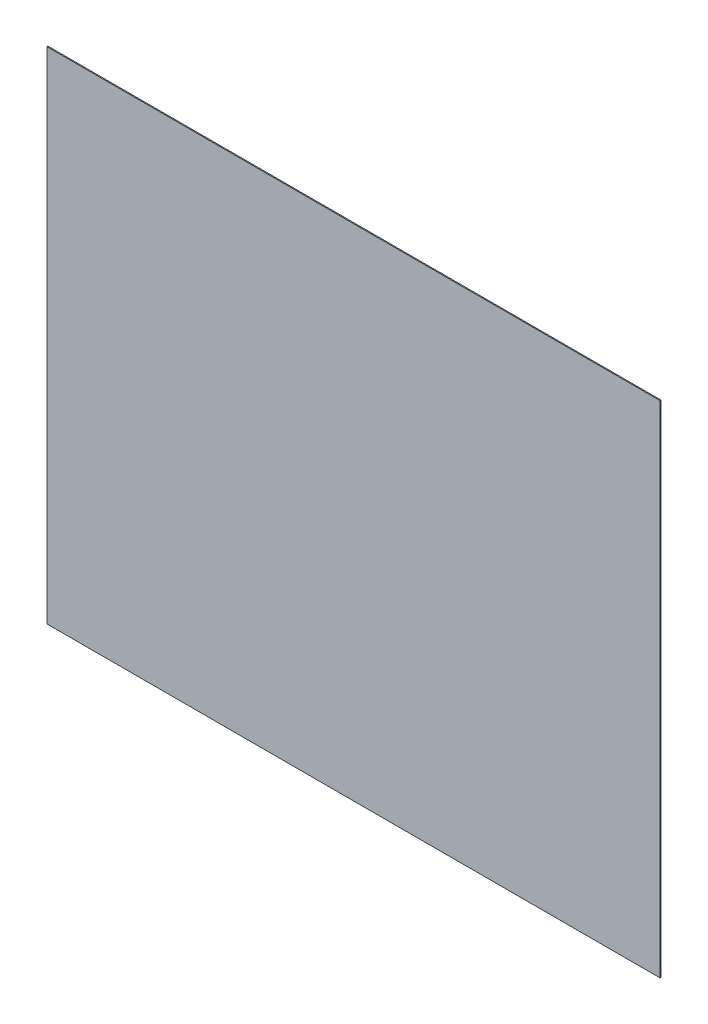
ISO-10303-21;
HEADER;
FILE_DESCRIPTION(('STEP AP214'),'2;1');
FILE_NAME('part.step','',(''),(''),'','','');
FILE_SCHEMA(('AUTOMOTIVE_DESIGN { 1 0 10303 214 1 1 1 1 }'));
ENDSEC;
DATA;
#1=APPLICATION_CONTEXT('core data for automotive mechanical design processes');
#2=APPLICATION_PROTOCOL_DEFINITION('international standard','automotive_design',2000,#1);
#3=PRODUCT_CONTEXT('',#1,'mechanical');
#4=PRODUCT('Part','Part','',(#3));
#5=PRODUCT_RELATED_PRODUCT_CATEGORY('part','',(#4));
#6=PRODUCT_DEFINITION_FORMATION('','',#4);
#7=PRODUCT_DEFINITION_CONTEXT('part definition',#1,'design');
#8=PRODUCT_DEFINITION('design','',#6,#7);
#9=PRODUCT_DEFINITION_SHAPE('','',#8);
#10=(LENGTH_UNIT() NAMED_UNIT(*) SI_UNIT(.MILLI.,.METRE.));
#11=(NAMED_UNIT(*) PLANE_ANGLE_UNIT() SI_UNIT($,.RADIAN.));
#12=(NAMED_UNIT(*) SI_UNIT($,.STERADIAN.) SOLID_ANGLE_UNIT());
#13=UNCERTAINTY_MEASURE_WITH_UNIT(LENGTH_MEASURE(1.E-05),#10,'distance_accuracy_value','');
#14=(GEOMETRIC_REPRESENTATION_CONTEXT(3) GLOBAL_UNCERTAINTY_ASSIGNED_CONTEXT((#13)) GLOBAL_UNIT_ASSIGNED_CONTEXT((#10,
#11,#12)) REPRESENTATION_CONTEXT('',''));
#15=CARTESIAN_POINT('',(0.,0.,0.));
#16=DIRECTION('',(0.,0.,1.));
#17=DIRECTION('',(1.,0.,0.));
#18=AXIS2_PLACEMENT_3D('',#15,#16,#17);
#19=CARTESIAN_POINT('',(0.,0.,2.733));
#20=DIRECTION('',(1.,0.,0.));
#21=DIRECTION('',(0.,0.,-1.));
#22=AXIS2_PLACEMENT_3D('',#19,#20,#21);
#23=PLANE('',#22);
#24=DIRECTION('',(0.,-1.,0.));
#25=VECTOR('',#24,1.);
#26=CARTESIAN_POINT('',(0.,0.,0.));
#27=LINE('',#26,#25);
#28=CARTESIAN_POINT('',(0.,1410.,0.));
#29=VERTEX_POINT('',#28);
#30=CARTESIAN_POINT('',(0.,0.,0.));
#31=VERTEX_POINT('',#30);
#32=EDGE_CURVE('E107',#29,#31,#27,.T.);
#33=ORIENTED_EDGE('',*,*,#32,.T.);
#34=DIRECTION('',(0.,0.,-1.));
#35=VECTOR('',#34,1.);
#36=CARTESIAN_POINT('',(0.,0.,2.733));
#37=LINE('',#36,#35);
#38=CARTESIAN_POINT('',(0.,0.,2.733));
#39=VERTEX_POINT('',#38);
#40=EDGE_CURVE('E11',#39,#31,#37,.T.);
#41=ORIENTED_EDGE('',*,*,#40,.F.);
#42=DIRECTION('',(0.,-1.,0.));
#43=VECTOR('',#42,1.);
#44=CARTESIAN_POINT('',(0.,0.,2.733));
#45=LINE('',#44,#43);
#46=CARTESIAN_POINT('',(0.,1410.,2.733));
#47=VERTEX_POINT('',#46);
#48=EDGE_CURVE('E91',#47,#39,#45,.T.);
#49=ORIENTED_EDGE('',*,*,#48,.F.);
#50=DIRECTION('',(0.,0.,-1.));
#51=VECTOR('',#50,1.);
#52=CARTESIAN_POINT('',(0.,1410.,2.733));
#53=LINE('',#52,#51);
#54=EDGE_CURVE('E103',#47,#29,#53,.T.);
#55=ORIENTED_EDGE('',*,*,#54,.T.);
#56=EDGE_LOOP('',(#33,#41,#49,#55));
#57=FACE_BOUND('',#56,.T.);
#58=ADVANCED_FACE('F39',(#57),#23,.F.);
#59=CARTESIAN_POINT('',(0.,0.,2.733));
#60=DIRECTION('',(0.,1.,0.));
#61=DIRECTION('',(0.,0.,1.));
#62=AXIS2_PLACEMENT_3D('',#59,#60,#61);
#63=PLANE('',#62);
#64=DIRECTION('',(1.,0.,0.));
#65=VECTOR('',#64,1.);
#66=CARTESIAN_POINT('',(0.,0.,0.));
#67=LINE('',#66,#65);
#68=CARTESIAN_POINT('',(1730.,0.,0.));
#69=VERTEX_POINT('',#68);
#70=EDGE_CURVE('E96',#31,#69,#67,.T.);
#71=ORIENTED_EDGE('',*,*,#70,.T.);
#72=DIRECTION('',(0.,0.,-1.));
#73=VECTOR('',#72,1.);
#74=CARTESIAN_POINT('',(1730.,0.,2.733));
#75=LINE('',#74,#73);
#76=CARTESIAN_POINT('',(1730.,0.,2.733));
#77=VERTEX_POINT('',#76);
#78=EDGE_CURVE('E48',#77,#69,#75,.T.);
#79=ORIENTED_EDGE('',*,*,#78,.F.);
#80=DIRECTION('',(1.,0.,0.));
#81=VECTOR('',#80,1.);
#82=CARTESIAN_POINT('',(0.,0.,2.733));
#83=LINE('',#82,#81);
#84=EDGE_CURVE('E86',#39,#77,#83,.T.);
#85=ORIENTED_EDGE('',*,*,#84,.F.);
#86=ORIENTED_EDGE('',*,*,#40,.T.);
#87=EDGE_LOOP('',(#71,#79,#85,#86));
#88=FACE_BOUND('',#87,.T.);
#89=ADVANCED_FACE('F95',(#88),#63,.F.);
#90=CARTESIAN_POINT('',(1730.,0.,2.733));
#91=DIRECTION('',(-1.,0.,0.));
#92=DIRECTION('',(0.,0.,1.));
#93=AXIS2_PLACEMENT_3D('',#90,#91,#92);
#94=PLANE('',#93);
#95=DIRECTION('',(0.,1.,0.));
#96=VECTOR('',#95,1.);
#97=CARTESIAN_POINT('',(1730.,0.,0.));
#98=LINE('',#97,#96);
#99=CARTESIAN_POINT('',(1730.,1410.,0.));
#100=VERTEX_POINT('',#99);
#101=EDGE_CURVE('E73',#69,#100,#98,.T.);
#102=ORIENTED_EDGE('',*,*,#101,.T.);
#103=DIRECTION('',(0.,0.,-1.));
#104=VECTOR('',#103,1.);
#105=CARTESIAN_POINT('',(1730.,1410.,2.733));
#106=LINE('',#105,#104);
#107=CARTESIAN_POINT('',(1730.,1410.,2.733));
#108=VERTEX_POINT('',#107);
#109=EDGE_CURVE('E98',#108,#100,#106,.T.);
#110=ORIENTED_EDGE('',*,*,#109,.F.);
#111=DIRECTION('',(0.,1.,0.));
#112=VECTOR('',#111,1.);
#113=CARTESIAN_POINT('',(1730.,0.,2.733));
#114=LINE('',#113,#112);
#115=EDGE_CURVE('E89',#77,#108,#114,.T.);
#116=ORIENTED_EDGE('',*,*,#115,.F.);
#117=ORIENTED_EDGE('',*,*,#78,.T.);
#118=EDGE_LOOP('',(#102,#110,#116,#117));
#119=FACE_BOUND('',#118,.T.);
#120=ADVANCED_FACE('F99',(#119),#94,.F.);
#121=CARTESIAN_POINT('',(0.,1410.,2.733));
#122=DIRECTION('',(0.,-1.,0.));
#123=DIRECTION('',(0.,0.,-1.));
#124=AXIS2_PLACEMENT_3D('',#121,#122,#123);
#125=PLANE('',#124);
#126=DIRECTION('',(-1.,0.,0.));
#127=VECTOR('',#126,1.);
#128=CARTESIAN_POINT('',(0.,1410.,0.));
#129=LINE('',#128,#127);
#130=EDGE_CURVE('E79',#100,#29,#129,.T.);
#131=ORIENTED_EDGE('',*,*,#130,.T.);
#132=ORIENTED_EDGE('',*,*,#54,.F.);
#133=DIRECTION('',(-1.,0.,0.));
#134=VECTOR('',#133,1.);
#135=CARTESIAN_POINT('',(0.,1410.,2.733));
#136=LINE('',#135,#134);
#137=EDGE_CURVE('E56',#108,#47,#136,.T.);
#138=ORIENTED_EDGE('',*,*,#137,.F.);
#139=ORIENTED_EDGE('',*,*,#109,.T.);
#140=EDGE_LOOP('',(#131,#132,#138,#139));
#141=FACE_BOUND('',#140,.T.);
#142=ADVANCED_FACE('F120',(#141),#125,.F.);
#143=CARTESIAN_POINT('',(0.,0.,2.733));
#144=DIRECTION('',(0.,0.,-1.));
#145=DIRECTION('',(-1.,0.,0.));
#146=AXIS2_PLACEMENT_3D('',#143,#144,#145);
#147=PLANE('',#146);
#148=ORIENTED_EDGE('',*,*,#48,.T.);
#149=ORIENTED_EDGE('',*,*,#84,.T.);
#150=ORIENTED_EDGE('',*,*,#115,.T.);
#151=ORIENTED_EDGE('',*,*,#137,.T.);
#152=EDGE_LOOP('',(#148,#149,#150,#151));
#153=FACE_BOUND('',#152,.T.);
#154=ADVANCED_FACE('F87',(#153),#147,.F.);
#155=CARTESIAN_POINT('',(0.,0.,0.));
#156=DIRECTION('',(0.,0.,-1.));
#157=DIRECTION('',(-1.,0.,0.));
#158=AXIS2_PLACEMENT_3D('',#155,#156,#157);
#159=PLANE('',#158);
#160=ORIENTED_EDGE('',*,*,#32,.F.);
#161=ORIENTED_EDGE('',*,*,#130,.F.);
#162=ORIENTED_EDGE('',*,*,#101,.F.);
#163=ORIENTED_EDGE('',*,*,#70,.F.);
#164=EDGE_LOOP('',(#160,#161,#162,#163));
#165=FACE_BOUND('',#164,.T.);
#166=ADVANCED_FACE('F123',(#165),#159,.T.);
#167=CLOSED_SHELL('',(#58,#89,#120,#142,#154,#166));
#168=MANIFOLD_SOLID_BREP('B2',#167);
#169=ADVANCED_BREP_SHAPE_REPRESENTATION('',(#18,#168),#14);
#170=SHAPE_DEFINITION_REPRESENTATION(#9,#169);
ENDSEC;
END-ISO-10303-21;
